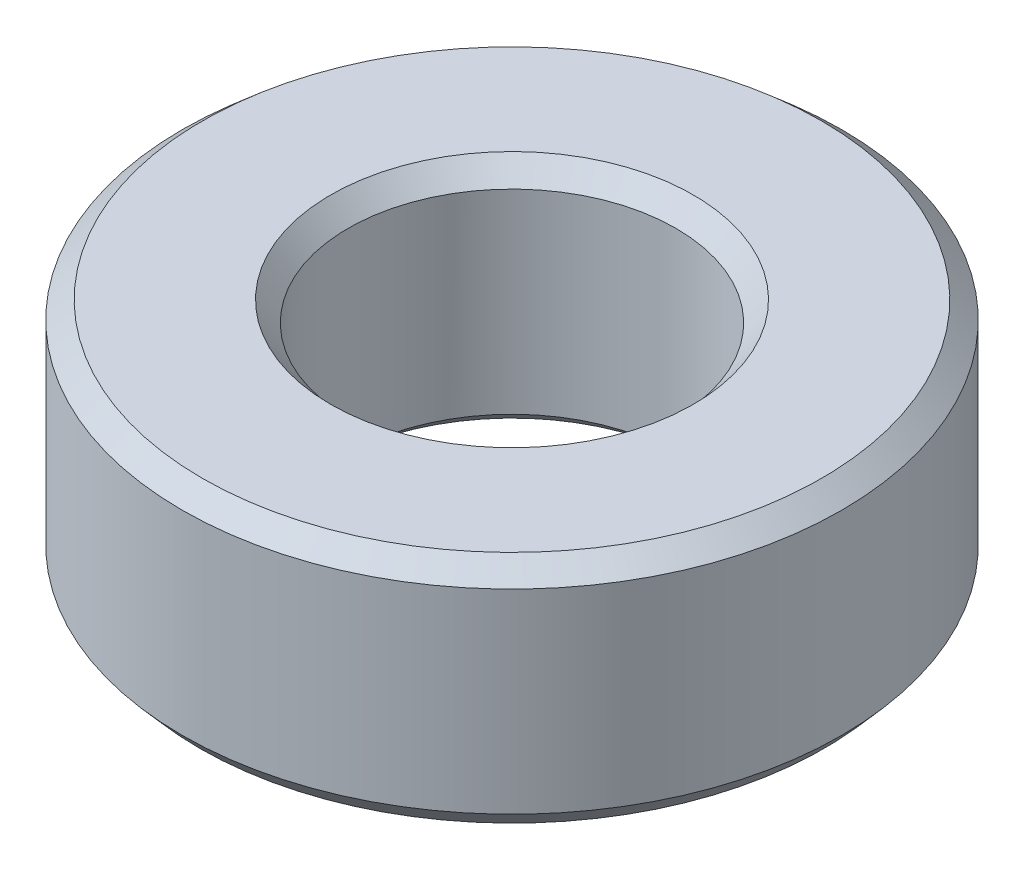
ISO-10303-21;
HEADER;
FILE_DESCRIPTION(('STEP AP214'),'2;1');
FILE_NAME('part.step','',(''),(''),'','','');
FILE_SCHEMA(('AUTOMOTIVE_DESIGN { 1 0 10303 214 1 1 1 1 }'));
ENDSEC;
DATA;
#1=APPLICATION_CONTEXT('core data for automotive mechanical design processes');
#2=APPLICATION_PROTOCOL_DEFINITION('international standard','automotive_design',2000,#1);
#3=PRODUCT_CONTEXT('',#1,'mechanical');
#4=PRODUCT('Part','Part','',(#3));
#5=PRODUCT_RELATED_PRODUCT_CATEGORY('part','',(#4));
#6=PRODUCT_DEFINITION_FORMATION('','',#4);
#7=PRODUCT_DEFINITION_CONTEXT('part definition',#1,'design');
#8=PRODUCT_DEFINITION('design','',#6,#7);
#9=PRODUCT_DEFINITION_SHAPE('','',#8);
#10=(LENGTH_UNIT() NAMED_UNIT(*) SI_UNIT(.MILLI.,.METRE.));
#11=(NAMED_UNIT(*) PLANE_ANGLE_UNIT() SI_UNIT($,.RADIAN.));
#12=(NAMED_UNIT(*) SI_UNIT($,.STERADIAN.) SOLID_ANGLE_UNIT());
#13=UNCERTAINTY_MEASURE_WITH_UNIT(LENGTH_MEASURE(1.E-05),#10,'distance_accuracy_value','');
#14=(GEOMETRIC_REPRESENTATION_CONTEXT(3) GLOBAL_UNCERTAINTY_ASSIGNED_CONTEXT((#13)) GLOBAL_UNIT_ASSIGNED_CONTEXT((#10,
#11,#12)) REPRESENTATION_CONTEXT('',''));
#15=CARTESIAN_POINT('',(0.,0.,0.));
#16=DIRECTION('',(0.,0.,1.));
#17=DIRECTION('',(1.,0.,0.));
#18=AXIS2_PLACEMENT_3D('',#15,#16,#17);
#19=CARTESIAN_POINT('',(0.,19.4047062605619,0.));
#20=DIRECTION('',(0.,-1.,0.));
#21=DIRECTION('',(0.,0.,-1.));
#22=AXIS2_PLACEMENT_3D('',#19,#20,#21);
#23=CYLINDRICAL_SURFACE('',#22,27.5);
#24=CARTESIAN_POINT('',(0.,1.67702673996238,0.));
#25=DIRECTION('',(0.,1.,0.));
#26=DIRECTION('',(0.,0.,1.));
#27=AXIS2_PLACEMENT_3D('',#24,#25,#26);
#28=CIRCLE('',#27,27.5);
#29=CARTESIAN_POINT('',(0.,1.67702673996238,-27.5));
#30=VERTEX_POINT('',#29);
#31=EDGE_CURVE('E10',#30,#30,#28,.T.);
#32=CARTESIAN_POINT('',(0.,17.9407344177965,0.));
#33=DIRECTION('',(0.,1.,0.));
#34=DIRECTION('',(0.,0.,1.));
#35=AXIS2_PLACEMENT_3D('',#32,#33,#34);
#36=CIRCLE('',#35,27.5);
#37=CARTESIAN_POINT('',(0.,17.9407344177965,-27.5));
#38=VERTEX_POINT('',#37);
#39=EDGE_CURVE('E50',#38,#38,#36,.F.);
#40=CARTESIAN_POINT('',(0.,1.67702673996238,-27.5));
#41=CARTESIAN_POINT('',(0.,1.84644036160649,-27.5));
#42=CARTESIAN_POINT('',(0.,2.01585398325059,-27.5));
#43=CARTESIAN_POINT('',(0.,2.3546812265388,-27.5));
#44=CARTESIAN_POINT('',(0.,2.52409484818291,-27.5));
#45=CARTESIAN_POINT('',(0.,2.86292209147112,-27.5));
#46=CARTESIAN_POINT('',(0.,3.03233571311522,-27.5));
#47=CARTESIAN_POINT('',(0.,3.37116295640343,-27.5));
#48=CARTESIAN_POINT('',(0.,3.54057657804754,-27.5));
#49=CARTESIAN_POINT('',(0.,3.87940382133575,-27.5));
#50=CARTESIAN_POINT('',(0.,4.04881744297986,-27.5));
#51=CARTESIAN_POINT('',(0.,4.38764468626807,-27.5));
#52=CARTESIAN_POINT('',(0.,4.55705830791217,-27.5));
#53=CARTESIAN_POINT('',(0.,4.89588555120038,-27.5));
#54=CARTESIAN_POINT('',(0.,5.06529917284449,-27.5));
#55=CARTESIAN_POINT('',(0.,5.4041264161327,-27.5));
#56=CARTESIAN_POINT('',(0.,5.5735400377768,-27.5));
#57=CARTESIAN_POINT('',(0.,5.91236728106501,-27.5));
#58=CARTESIAN_POINT('',(0.,6.08178090270912,-27.5));
#59=CARTESIAN_POINT('',(0.,6.42060814599733,-27.5));
#60=CARTESIAN_POINT('',(0.,6.59002176764143,-27.5));
#61=CARTESIAN_POINT('',(0.,6.92884901092965,-27.5));
#62=CARTESIAN_POINT('',(0.,7.09826263257375,-27.5));
#63=CARTESIAN_POINT('',(0.,7.43708987586196,-27.5));
#64=CARTESIAN_POINT('',(0.,7.60650349750607,-27.5));
#65=CARTESIAN_POINT('',(0.,7.94533074079428,-27.5));
#66=CARTESIAN_POINT('',(0.,8.11474436243839,-27.5));
#67=CARTESIAN_POINT('',(0.,8.4535716057266,-27.5));
#68=CARTESIAN_POINT('',(0.,8.6229852273707,-27.5));
#69=CARTESIAN_POINT('',(0.,8.96181247065891,-27.5));
#70=CARTESIAN_POINT('',(0.,9.13122609230302,-27.5));
#71=CARTESIAN_POINT('',(0.,9.47005333559123,-27.5));
#72=CARTESIAN_POINT('',(0.,9.63946695723533,-27.5));
#73=CARTESIAN_POINT('',(0.,9.97829420052354,-27.5));
#74=CARTESIAN_POINT('',(0.,10.1477078221676,-27.5));
#75=CARTESIAN_POINT('',(0.,10.4865350654559,-27.5));
#76=CARTESIAN_POINT('',(0.,10.6559486871,-27.5));
#77=CARTESIAN_POINT('',(0.,10.9947759303882,-27.5));
#78=CARTESIAN_POINT('',(0.,11.1641895520323,-27.5));
#79=CARTESIAN_POINT('',(0.,11.5030167953205,-27.5));
#80=CARTESIAN_POINT('',(0.,11.6724304169646,-27.5));
#81=CARTESIAN_POINT('',(0.,12.0112576602528,-27.5));
#82=CARTESIAN_POINT('',(0.,12.1806712818969,-27.5));
#83=CARTESIAN_POINT('',(0.,12.5194985251851,-27.5));
#84=CARTESIAN_POINT('',(0.,12.6889121468292,-27.5));
#85=CARTESIAN_POINT('',(0.,13.0277393901174,-27.5));
#86=CARTESIAN_POINT('',(0.,13.1971530117615,-27.5));
#87=CARTESIAN_POINT('',(0.,13.5359802550498,-27.5));
#88=CARTESIAN_POINT('',(0.,13.7053938766939,-27.5));
#89=CARTESIAN_POINT('',(0.,14.0442211199821,-27.5));
#90=CARTESIAN_POINT('',(0.,14.2136347416262,-27.5));
#91=CARTESIAN_POINT('',(0.,14.5524619849144,-27.5));
#92=CARTESIAN_POINT('',(0.,14.7218756065585,-27.5));
#93=CARTESIAN_POINT('',(0.,15.0607028498467,-27.5));
#94=CARTESIAN_POINT('',(0.,15.2301164714908,-27.5));
#95=CARTESIAN_POINT('',(0.,15.568943714779,-27.5));
#96=CARTESIAN_POINT('',(0.,15.7383573364231,-27.5));
#97=CARTESIAN_POINT('',(0.,16.0771845797113,-27.5));
#98=CARTESIAN_POINT('',(0.,16.2465982013554,-27.5));
#99=CARTESIAN_POINT('',(0.,16.5854254446437,-27.5));
#100=CARTESIAN_POINT('',(0.,16.7548390662878,-27.5));
#101=CARTESIAN_POINT('',(0.,17.093666309576,-27.5));
#102=CARTESIAN_POINT('',(0.,17.2630799312201,-27.5));
#103=CARTESIAN_POINT('',(0.,17.6019071745083,-27.5));
#104=CARTESIAN_POINT('',(0.,17.7713207961524,-27.5));
#105=CARTESIAN_POINT('',(0.,17.9407344177965,-27.5));
#106=B_SPLINE_CURVE_WITH_KNOTS('',3,(#40,#41,#42,#43,#44,#45,#46,#47,#48,#49,#50,#51,#52,#53,
#54,#55,#56,#57,#58,#59,#60,#61,#62,#63,#64,#65,#66,#67,#68,#69,#70,#71,#72,#73,#74,#75,#76,#77,
#78,#79,#80,#81,#82,#83,#84,#85,#86,#87,#88,#89,#90,#91,#92,#93,#94,#95,#96,#97,#98,#99,#100,
#101,#102,#103,#104,#105),.UNSPECIFIED.,.F.,.F.,(4,2,2,2,2,2,2,2,2,2,2,2,2,2,2,2,2,2,2,2,2,2,2,
2,2,2,2,2,2,2,2,2,4),(0.,0.508240864932317,1.01648172986463,1.52472259479695,2.03296345972926,
2.54120432466158,3.0494451895939,3.55768605452621,4.06592691945853,4.57416778439084,
5.08240864932316,5.59064951425548,6.09889037918779,6.60713124412011,7.11537210905242,
7.62361297398474,8.13185383891706,8.64009470384937,9.14833556878169,9.65657643371401,
10.1648172986463,10.6730581635786,11.181299028511,11.6895398934433,12.1977807583756,
12.7060216233079,13.2142624882402,13.7225033531725,14.2307442181048,14.7389850830372,
15.2472259479695,15.7554668129018,16.2637076778341),.UNSPECIFIED.);
#107=EDGE_CURVE('BSEAM39',#30,#38,#106,.T.);
#108=ORIENTED_EDGE('',*,*,#31,.T.);
#109=ORIENTED_EDGE('',*,*,#39,.T.);
#110=ORIENTED_EDGE('',*,*,#107,.T.);
#111=ORIENTED_EDGE('',*,*,#107,.F.);
#112=EDGE_LOOP('',(#108,#110,#109,#111));
#113=FACE_BOUND('',#112,.T.);
#114=ADVANCED_FACE('F39',(#113),#23,.T.);
#115=CARTESIAN_POINT('',(0.,19.4047062605619,0.));
#116=DIRECTION('',(0.,1.,0.));
#117=DIRECTION('',(0.,0.,1.));
#118=AXIS2_PLACEMENT_3D('',#115,#116,#117);
#119=PLANE('',#118);
#120=CARTESIAN_POINT('',(0.,19.4047062605619,0.));
#121=DIRECTION('',(0.,1.,0.));
#122=DIRECTION('',(0.,0.,1.));
#123=AXIS2_PLACEMENT_3D('',#120,#121,#122);
#124=CIRCLE('',#123,15.1300444740957);
#125=CARTESIAN_POINT('',(0.,19.4047062605619,15.1300444740957));
#126=VERTEX_POINT('',#125);
#127=EDGE_CURVE('E58',#126,#126,#124,.F.);
#128=ORIENTED_EDGE('',*,*,#127,.T.);
#129=EDGE_LOOP('',(#128));
#130=FACE_BOUND('',#129,.T.);
#131=CARTESIAN_POINT('',(0.,19.4047062605619,0.));
#132=DIRECTION('',(0.,1.,0.));
#133=DIRECTION('',(0.,0.,1.));
#134=AXIS2_PLACEMENT_3D('',#131,#132,#133);
#135=CIRCLE('',#134,25.8229732600377);
#136=CARTESIAN_POINT('',(0.,19.4047062605619,25.8229732600377));
#137=VERTEX_POINT('',#136);
#138=EDGE_CURVE('E61',#137,#137,#135,.T.);
#139=ORIENTED_EDGE('',*,*,#138,.T.);
#140=EDGE_LOOP('',(#139));
#141=FACE_BOUND('',#140,.T.);
#142=ADVANCED_FACE('F88',(#130,#141),#119,.T.);
#143=CARTESIAN_POINT('',(0.,0.,0.));
#144=DIRECTION('',(0.,1.,0.));
#145=DIRECTION('',(0.,0.,1.));
#146=AXIS2_PLACEMENT_3D('',#143,#144,#145);
#147=PLANE('',#146);
#148=CARTESIAN_POINT('',(0.,0.,0.));
#149=DIRECTION('',(0.,1.,0.));
#150=DIRECTION('',(0.,0.,1.));
#151=AXIS2_PLACEMENT_3D('',#148,#149,#150);
#152=CIRCLE('',#151,15.3430993712925);
#153=CARTESIAN_POINT('',(0.,0.,15.3430993712925));
#154=VERTEX_POINT('',#153);
#155=EDGE_CURVE('E51',#154,#154,#152,.T.);
#156=ORIENTED_EDGE('',*,*,#155,.T.);
#157=EDGE_LOOP('',(#156));
#158=FACE_BOUND('',#157,.T.);
#159=CARTESIAN_POINT('',(0.,0.,0.));
#160=DIRECTION('',(0.,1.,0.));
#161=DIRECTION('',(0.,0.,1.));
#162=AXIS2_PLACEMENT_3D('',#159,#160,#161);
#163=CIRCLE('',#162,26.0360281572346);
#164=CARTESIAN_POINT('',(0.,0.,26.0360281572346));
#165=VERTEX_POINT('',#164);
#166=EDGE_CURVE('E54',#165,#165,#163,.F.);
#167=ORIENTED_EDGE('',*,*,#166,.T.);
#168=EDGE_LOOP('',(#167));
#169=FACE_BOUND('',#168,.T.);
#170=ADVANCED_FACE('F83',(#158,#169),#147,.F.);
#171=CARTESIAN_POINT('',(0.,19.4047062605619,0.));
#172=DIRECTION('',(0.,-1.,0.));
#173=DIRECTION('',(0.,0.,-1.));
#174=AXIS2_PLACEMENT_3D('',#171,#172,#173);
#175=CYLINDRICAL_SURFACE('',#174,13.6660726313302);
#176=CARTESIAN_POINT('',(0.,17.7276795205995,0.));
#177=DIRECTION('',(0.,1.,0.));
#178=DIRECTION('',(0.,0.,1.));
#179=AXIS2_PLACEMENT_3D('',#176,#177,#178);
#180=CIRCLE('',#179,13.6660726313302);
#181=CARTESIAN_POINT('',(0.,17.7276795205995,-13.6660726313302));
#182=VERTEX_POINT('',#181);
#183=EDGE_CURVE('E67',#182,#182,#180,.T.);
#184=CARTESIAN_POINT('',(0.,1.46397184276538,0.));
#185=DIRECTION('',(0.,1.,0.));
#186=DIRECTION('',(0.,0.,1.));
#187=AXIS2_PLACEMENT_3D('',#184,#185,#186);
#188=CIRCLE('',#187,13.6660726313302);
#189=CARTESIAN_POINT('',(0.,1.46397184276538,-13.6660726313302));
#190=VERTEX_POINT('',#189);
#191=EDGE_CURVE('E69',#190,#190,#188,.F.);
#192=CARTESIAN_POINT('',(0.,17.7276795205995,-13.6660726313302));
#193=CARTESIAN_POINT('',(0.,17.5582658989554,-13.6660726313302));
#194=CARTESIAN_POINT('',(0.,17.3888522773113,-13.6660726313302));
#195=CARTESIAN_POINT('',(0.,17.0500250340231,-13.6660726313302));
#196=CARTESIAN_POINT('',(0.,16.880611412379,-13.6660726313302));
#197=CARTESIAN_POINT('',(0.,16.5417841690907,-13.6660726313302));
#198=CARTESIAN_POINT('',(0.,16.3723705474466,-13.6660726313302));
#199=CARTESIAN_POINT('',(0.,16.0335433041584,-13.6660726313302));
#200=CARTESIAN_POINT('',(0.,15.8641296825143,-13.6660726313302));
#201=CARTESIAN_POINT('',(0.,15.5253024392261,-13.6660726313302));
#202=CARTESIAN_POINT('',(0.,15.355888817582,-13.6660726313302));
#203=CARTESIAN_POINT('',(0.,15.0170615742938,-13.6660726313302));
#204=CARTESIAN_POINT('',(0.,14.8476479526497,-13.6660726313302));
#205=CARTESIAN_POINT('',(0.,14.5088207093615,-13.6660726313302));
#206=CARTESIAN_POINT('',(0.,14.3394070877174,-13.6660726313302));
#207=CARTESIAN_POINT('',(0.,14.0005798444292,-13.6660726313302));
#208=CARTESIAN_POINT('',(0.,13.8311662227851,-13.6660726313302));
#209=CARTESIAN_POINT('',(0.,13.4923389794968,-13.6660726313302));
#210=CARTESIAN_POINT('',(0.,13.3229253578527,-13.6660726313302));
#211=CARTESIAN_POINT('',(0.,12.9840981145645,-13.6660726313302));
#212=CARTESIAN_POINT('',(0.,12.8146844929204,-13.6660726313302));
#213=CARTESIAN_POINT('',(0.,12.4758572496322,-13.6660726313302));
#214=CARTESIAN_POINT('',(0.,12.3064436279881,-13.6660726313302));
#215=CARTESIAN_POINT('',(0.,11.9676163846999,-13.6660726313302));
#216=CARTESIAN_POINT('',(0.,11.7982027630558,-13.6660726313302));
#217=CARTESIAN_POINT('',(0.,11.4593755197676,-13.6660726313302));
#218=CARTESIAN_POINT('',(0.,11.2899618981235,-13.6660726313302));
#219=CARTESIAN_POINT('',(0.,10.9511346548353,-13.6660726313302));
#220=CARTESIAN_POINT('',(0.,10.7817210331912,-13.6660726313302));
#221=CARTESIAN_POINT('',(0.,10.442893789903,-13.6660726313302));
#222=CARTESIAN_POINT('',(0.,10.2734801682588,-13.6660726313302));
#223=CARTESIAN_POINT('',(0.,9.93465292497064,-13.6660726313302));
#224=CARTESIAN_POINT('',(0.,9.76523930332653,-13.6660726313302));
#225=CARTESIAN_POINT('',(0.,9.42641206003832,-13.6660726313302));
#226=CARTESIAN_POINT('',(0.,9.25699843839422,-13.6660726313302));
#227=CARTESIAN_POINT('',(0.,8.91817119510601,-13.6660726313302));
#228=CARTESIAN_POINT('',(0.,8.7487575734619,-13.6660726313302));
#229=CARTESIAN_POINT('',(0.,8.40993033017369,-13.6660726313302));
#230=CARTESIAN_POINT('',(0.,8.24051670852958,-13.6660726313302));
#231=CARTESIAN_POINT('',(0.,7.90168946524137,-13.6660726313302));
#232=CARTESIAN_POINT('',(0.,7.73227584359727,-13.6660726313302));
#233=CARTESIAN_POINT('',(0.,7.39344860030906,-13.6660726313302));
#234=CARTESIAN_POINT('',(0.,7.22403497866495,-13.6660726313302));
#235=CARTESIAN_POINT('',(0.,6.88520773537674,-13.6660726313302));
#236=CARTESIAN_POINT('',(0.,6.71579411373264,-13.6660726313302));
#237=CARTESIAN_POINT('',(0.,6.37696687044443,-13.6660726313302));
#238=CARTESIAN_POINT('',(0.,6.20755324880032,-13.6660726313302));
#239=CARTESIAN_POINT('',(0.,5.86872600551211,-13.6660726313302));
#240=CARTESIAN_POINT('',(0.,5.69931238386801,-13.6660726313302));
#241=CARTESIAN_POINT('',(0.,5.3604851405798,-13.6660726313302));
#242=CARTESIAN_POINT('',(0.,5.19107151893569,-13.6660726313302));
#243=CARTESIAN_POINT('',(0.,4.85224427564748,-13.6660726313302));
#244=CARTESIAN_POINT('',(0.,4.68283065400338,-13.6660726313302));
#245=CARTESIAN_POINT('',(0.,4.34400341071516,-13.6660726313302));
#246=CARTESIAN_POINT('',(0.,4.17458978907106,-13.6660726313302));
#247=CARTESIAN_POINT('',(0.,3.83576254578285,-13.6660726313302));
#248=CARTESIAN_POINT('',(0.,3.66634892413874,-13.6660726313302));
#249=CARTESIAN_POINT('',(0.,3.32752168085054,-13.6660726313302));
#250=CARTESIAN_POINT('',(0.,3.15810805920643,-13.6660726313302));
#251=CARTESIAN_POINT('',(0.,2.81928081591822,-13.6660726313302));
#252=CARTESIAN_POINT('',(0.,2.64986719427412,-13.6660726313302));
#253=CARTESIAN_POINT('',(0.,2.3110399509859,-13.6660726313302));
#254=CARTESIAN_POINT('',(0.,2.1416263293418,-13.6660726313302));
#255=CARTESIAN_POINT('',(0.,1.80279908605359,-13.6660726313302));
#256=CARTESIAN_POINT('',(0.,1.63338546440948,-13.6660726313302));
#257=CARTESIAN_POINT('',(0.,1.46397184276538,-13.6660726313302));
#258=B_SPLINE_CURVE_WITH_KNOTS('',3,(#192,#193,#194,#195,#196,#197,#198,#199,#200,#201,#202,
#203,#204,#205,#206,#207,#208,#209,#210,#211,#212,#213,#214,#215,#216,#217,#218,#219,#220,#221,
#222,#223,#224,#225,#226,#227,#228,#229,#230,#231,#232,#233,#234,#235,#236,#237,#238,#239,#240,
#241,#242,#243,#244,#245,#246,#247,#248,#249,#250,#251,#252,#253,#254,#255,#256,#257),
.UNSPECIFIED.,.F.,.F.,(4,2,2,2,2,2,2,2,2,2,2,2,2,2,2,2,2,2,2,2,2,2,2,2,2,2,2,2,2,2,2,2,4),(0.,
0.508240864932317,1.01648172986463,1.52472259479695,2.03296345972926,2.54120432466158,
3.04944518959389,3.55768605452621,4.06592691945853,4.57416778439084,5.08240864932316,
5.59064951425547,6.09889037918779,6.6071312441201,7.11537210905242,7.62361297398474,
8.13185383891705,8.64009470384937,9.14833556878168,9.656576433714,10.1648172986463,
10.6730581635786,11.1812990285109,11.6895398934433,12.1977807583756,12.7060216233079,
13.2142624882402,13.7225033531725,14.2307442181048,14.7389850830372,15.2472259479695,
15.7554668129018,16.2637076778341),.UNSPECIFIED.);
#259=EDGE_CURVE('BSEAM71',#182,#190,#258,.T.);
#260=ORIENTED_EDGE('',*,*,#183,.T.);
#261=ORIENTED_EDGE('',*,*,#191,.T.);
#262=ORIENTED_EDGE('',*,*,#259,.T.);
#263=ORIENTED_EDGE('',*,*,#259,.F.);
#264=EDGE_LOOP('',(#260,#262,#261,#263));
#265=FACE_BOUND('',#264,.T.);
#266=ADVANCED_FACE('F71',(#265),#175,.F.);
#267=CARTESIAN_POINT('',(0.,17.7276795205995,0.));
#268=DIRECTION('',(0.,1.,0.));
#269=DIRECTION('',(0.,0.,1.));
#270=AXIS2_PLACEMENT_3D('',#267,#268,#269);
#271=CONICAL_SURFACE('',#270,13.6660726313302,0.717671598427048);
#272=ORIENTED_EDGE('',*,*,#127,.F.);
#273=EDGE_LOOP('',(#272));
#274=FACE_BOUND('',#273,.T.);
#275=ORIENTED_EDGE('',*,*,#183,.F.);
#276=EDGE_LOOP('',(#275));
#277=FACE_BOUND('',#276,.T.);
#278=ADVANCED_FACE('F77',(#274,#277),#271,.F.);
#279=CARTESIAN_POINT('',(0.,0.,0.));
#280=DIRECTION('',(0.,-1.,0.));
#281=DIRECTION('',(0.,0.,-1.));
#282=AXIS2_PLACEMENT_3D('',#279,#280,#281);
#283=CONICAL_SURFACE('',#282,15.3430993712925,0.853124728367845);
#284=ORIENTED_EDGE('',*,*,#191,.F.);
#285=EDGE_LOOP('',(#284));
#286=FACE_BOUND('',#285,.T.);
#287=ORIENTED_EDGE('',*,*,#155,.F.);
#288=EDGE_LOOP('',(#287));
#289=FACE_BOUND('',#288,.T.);
#290=ADVANCED_FACE('F73',(#286,#289),#283,.F.);
#291=CARTESIAN_POINT('',(0.,1.67702673996238,0.));
#292=DIRECTION('',(0.,1.,0.));
#293=DIRECTION('',(0.,0.,1.));
#294=AXIS2_PLACEMENT_3D('',#291,#292,#293);
#295=CONICAL_SURFACE('',#294,27.5,0.717671598427051);
#296=ORIENTED_EDGE('',*,*,#166,.F.);
#297=EDGE_LOOP('',(#296));
#298=FACE_BOUND('',#297,.T.);
#299=ORIENTED_EDGE('',*,*,#31,.F.);
#300=EDGE_LOOP('',(#299));
#301=FACE_BOUND('',#300,.T.);
#302=ADVANCED_FACE('F76',(#298,#301),#295,.T.);
#303=CARTESIAN_POINT('',(0.,19.4047062605619,0.));
#304=DIRECTION('',(0.,-1.,0.));
#305=DIRECTION('',(0.,0.,-1.));
#306=AXIS2_PLACEMENT_3D('',#303,#304,#305);
#307=CONICAL_SURFACE('',#306,25.8229732600377,0.853124728367844);
#308=ORIENTED_EDGE('',*,*,#39,.F.);
#309=EDGE_LOOP('',(#308));
#310=FACE_BOUND('',#309,.T.);
#311=ORIENTED_EDGE('',*,*,#138,.F.);
#312=EDGE_LOOP('',(#311));
#313=FACE_BOUND('',#312,.T.);
#314=ADVANCED_FACE('F45',(#310,#313),#307,.T.);
#315=CLOSED_SHELL('',(#114,#142,#170,#266,#278,#290,#302,#314));
#316=MANIFOLD_SOLID_BREP('B2',#315);
#317=ADVANCED_BREP_SHAPE_REPRESENTATION('',(#18,#316),#14);
#318=SHAPE_DEFINITION_REPRESENTATION(#9,#317);
ENDSEC;
END-ISO-10303-21;
